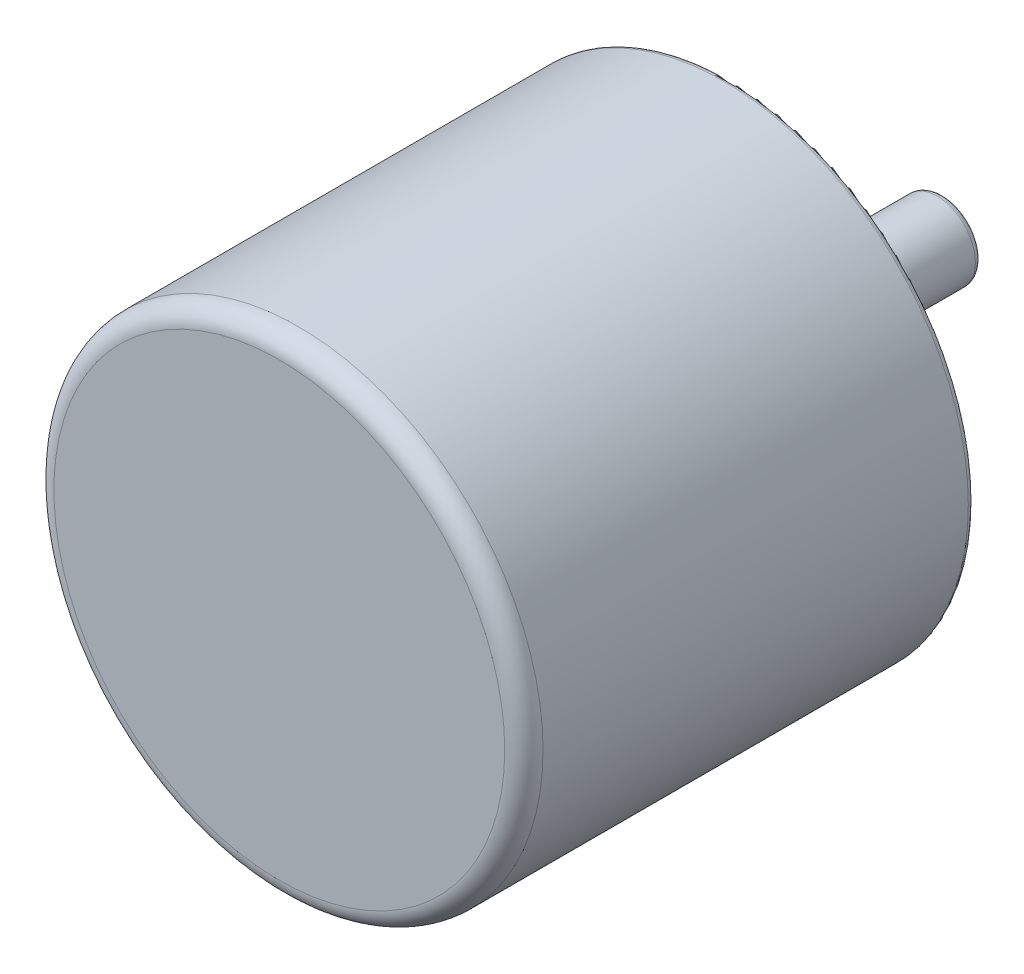
ISO-10303-21;
HEADER;
FILE_DESCRIPTION(('STEP AP214'),'2;1');
FILE_NAME('part.step','',(''),(''),'','','');
FILE_SCHEMA(('AUTOMOTIVE_DESIGN { 1 0 10303 214 1 1 1 1 }'));
ENDSEC;
DATA;
#1=APPLICATION_CONTEXT('core data for automotive mechanical design processes');
#2=APPLICATION_PROTOCOL_DEFINITION('international standard','automotive_design',2000,#1);
#3=PRODUCT_CONTEXT('',#1,'mechanical');
#4=PRODUCT('Part','Part','',(#3));
#5=PRODUCT_RELATED_PRODUCT_CATEGORY('part','',(#4));
#6=PRODUCT_DEFINITION_FORMATION('','',#4);
#7=PRODUCT_DEFINITION_CONTEXT('part definition',#1,'design');
#8=PRODUCT_DEFINITION('design','',#6,#7);
#9=PRODUCT_DEFINITION_SHAPE('','',#8);
#10=(LENGTH_UNIT() NAMED_UNIT(*) SI_UNIT(.MILLI.,.METRE.));
#11=(NAMED_UNIT(*) PLANE_ANGLE_UNIT() SI_UNIT($,.RADIAN.));
#12=(NAMED_UNIT(*) SI_UNIT($,.STERADIAN.) SOLID_ANGLE_UNIT());
#13=UNCERTAINTY_MEASURE_WITH_UNIT(LENGTH_MEASURE(1.E-05),#10,'distance_accuracy_value','');
#14=(GEOMETRIC_REPRESENTATION_CONTEXT(3) GLOBAL_UNCERTAINTY_ASSIGNED_CONTEXT((#13)) GLOBAL_UNIT_ASSIGNED_CONTEXT((#10,
#11,#12)) REPRESENTATION_CONTEXT('',''));
#15=CARTESIAN_POINT('',(0.,0.,0.));
#16=DIRECTION('',(0.,0.,1.));
#17=DIRECTION('',(1.,0.,0.));
#18=AXIS2_PLACEMENT_3D('',#15,#16,#17);
#19=CARTESIAN_POINT('',(0.,0.,35.3));
#20=DIRECTION('',(0.,0.,-1.));
#21=DIRECTION('',(-1.,0.,0.));
#22=AXIS2_PLACEMENT_3D('',#19,#20,#21);
#23=CYLINDRICAL_SURFACE('',#22,19.15);
#24=CARTESIAN_POINT('',(0.,0.,0.5));
#25=DIRECTION('',(0.,0.,1.));
#26=DIRECTION('',(1.,0.,0.));
#27=AXIS2_PLACEMENT_3D('',#24,#25,#26);
#28=CIRCLE('',#27,19.15);
#29=CARTESIAN_POINT('',(19.15,0.,0.5));
#30=VERTEX_POINT('',#29);
#31=EDGE_CURVE('E37',#30,#30,#28,.T.);
#32=ORIENTED_EDGE('',*,*,#31,.T.);
#33=EDGE_LOOP('',(#32));
#34=FACE_BOUND('',#33,.T.);
#35=CARTESIAN_POINT('',(0.,0.,33.8));
#36=DIRECTION('',(0.,0.,1.));
#37=DIRECTION('',(1.,0.,0.));
#38=AXIS2_PLACEMENT_3D('',#35,#36,#37);
#39=CIRCLE('',#38,19.15);
#40=CARTESIAN_POINT('',(19.15,0.,33.8));
#41=VERTEX_POINT('',#40);
#42=EDGE_CURVE('E56',#41,#41,#39,.F.);
#43=ORIENTED_EDGE('',*,*,#42,.T.);
#44=EDGE_LOOP('',(#43));
#45=FACE_BOUND('',#44,.T.);
#46=ADVANCED_FACE('F30',(#34,#45),#23,.T.);
#47=CARTESIAN_POINT('',(0.,0.,35.3));
#48=DIRECTION('',(0.,0.,1.));
#49=DIRECTION('',(1.,0.,0.));
#50=AXIS2_PLACEMENT_3D('',#47,#48,#49);
#51=PLANE('',#50);
#52=CARTESIAN_POINT('',(0.,0.,35.3));
#53=DIRECTION('',(0.,0.,1.));
#54=DIRECTION('',(1.,0.,0.));
#55=AXIS2_PLACEMENT_3D('',#52,#53,#54);
#56=CIRCLE('',#55,17.65);
#57=CARTESIAN_POINT('',(17.65,0.,35.3));
#58=VERTEX_POINT('',#57);
#59=EDGE_CURVE('E59',#58,#58,#56,.T.);
#60=ORIENTED_EDGE('',*,*,#59,.T.);
#61=EDGE_LOOP('',(#60));
#62=FACE_BOUND('',#61,.T.);
#63=ADVANCED_FACE('F124',(#62),#51,.T.);
#64=CARTESIAN_POINT('',(0.,0.,0.));
#65=DIRECTION('',(0.,0.,1.));
#66=DIRECTION('',(1.,0.,0.));
#67=AXIS2_PLACEMENT_3D('',#64,#65,#66);
#68=PLANE('',#67);
#69=CARTESIAN_POINT('',(0.,0.,0.));
#70=DIRECTION('',(0.,0.,1.));
#71=DIRECTION('',(1.,0.,0.));
#72=AXIS2_PLACEMENT_3D('',#69,#70,#71);
#73=CIRCLE('',#72,18.65);
#74=CARTESIAN_POINT('',(18.65,0.,0.));
#75=VERTEX_POINT('',#74);
#76=EDGE_CURVE('E10',#75,#75,#73,.F.);
#77=ORIENTED_EDGE('',*,*,#76,.T.);
#78=EDGE_LOOP('',(#77));
#79=FACE_BOUND('',#78,.T.);
#80=CARTESIAN_POINT('',(9.78471235545165,-10.2216390134391,0.));
#81=DIRECTION('',(0.,0.,-1.));
#82=DIRECTION('',(-1.,0.,0.));
#83=AXIS2_PLACEMENT_3D('',#80,#81,#82);
#84=CIRCLE('',#83,1.0085221382896);
#85=CARTESIAN_POINT('',(8.77619021716205,-10.2216390134391,0.));
#86=VERTEX_POINT('',#85);
#87=EDGE_CURVE('E81',#86,#86,#84,.T.);
#88=ORIENTED_EDGE('',*,*,#87,.F.);
#89=EDGE_LOOP('',(#88));
#90=FACE_BOUND('',#89,.T.);
#91=CARTESIAN_POINT('',(-12.2542594635513,-7.07499999999912,0.));
#92=DIRECTION('',(0.,0.,-1.));
#93=DIRECTION('',(-1.,0.,0.));
#94=AXIS2_PLACEMENT_3D('',#91,#92,#93);
#95=CIRCLE('',#94,1.02634430811281);
#96=CARTESIAN_POINT('',(-13.2806037716641,-7.07499999999912,0.));
#97=VERTEX_POINT('',#96);
#98=EDGE_CURVE('E95',#97,#97,#95,.T.);
#99=ORIENTED_EDGE('',*,*,#98,.F.);
#100=EDGE_LOOP('',(#99));
#101=FACE_BOUND('',#100,.T.);
#102=CARTESIAN_POINT('',(3.95984287622503,13.584628975265,0.));
#103=DIRECTION('',(0.,0.,-1.));
#104=DIRECTION('',(-1.,0.,0.));
#105=AXIS2_PLACEMENT_3D('',#102,#103,#104);
#106=CIRCLE('',#105,1.00852213828777);
#107=CARTESIAN_POINT('',(2.95132073793726,13.584628975265,0.));
#108=VERTEX_POINT('',#107);
#109=EDGE_CURVE('E88',#108,#108,#106,.T.);
#110=ORIENTED_EDGE('',*,*,#109,.F.);
#111=EDGE_LOOP('',(#110));
#112=FACE_BOUND('',#111,.T.);
#113=CARTESIAN_POINT('',(-13.7445552316797,-3.36298996182591,0.));
#114=DIRECTION('',(0.,0.,-1.));
#115=DIRECTION('',(-1.,0.,0.));
#116=AXIS2_PLACEMENT_3D('',#113,#114,#115);
#117=CIRCLE('',#116,1.00852213828903);
#118=CARTESIAN_POINT('',(-14.7530773699687,-3.36298996182591,0.));
#119=VERTEX_POINT('',#118);
#120=EDGE_CURVE('E105',#119,#119,#117,.T.);
#121=ORIENTED_EDGE('',*,*,#120,.F.);
#122=EDGE_LOOP('',(#121));
#123=FACE_BOUND('',#122,.T.);
#124=CARTESIAN_POINT('',(12.2542594635483,-7.07500000000088,0.));
#125=DIRECTION('',(0.,0.,-1.));
#126=DIRECTION('',(-1.,0.,0.));
#127=AXIS2_PLACEMENT_3D('',#124,#125,#126);
#128=CIRCLE('',#127,1.02634430811338);
#129=CARTESIAN_POINT('',(11.2279151554349,-7.07500000000088,0.));
#130=VERTEX_POINT('',#129);
#131=EDGE_CURVE('E87',#130,#130,#128,.T.);
#132=ORIENTED_EDGE('',*,*,#131,.F.);
#133=EDGE_LOOP('',(#132));
#134=FACE_BOUND('',#133,.T.);
#135=CARTESIAN_POINT('',(0.,14.15,0.));
#136=DIRECTION('',(0.,0.,-1.));
#137=DIRECTION('',(-1.,0.,0.));
#138=AXIS2_PLACEMENT_3D('',#135,#136,#137);
#139=CIRCLE('',#138,1.02634430811155);
#140=CARTESIAN_POINT('',(-1.02634430811155,14.15,0.));
#141=VERTEX_POINT('',#140);
#142=EDGE_CURVE('E75',#141,#141,#139,.T.);
#143=ORIENTED_EDGE('',*,*,#142,.F.);
#144=EDGE_LOOP('',(#143));
#145=FACE_BOUND('',#144,.T.);
#146=CARTESIAN_POINT('',(0.,0.,0.));
#147=DIRECTION('',(0.,0.,1.));
#148=DIRECTION('',(1.,0.,0.));
#149=AXIS2_PLACEMENT_3D('',#146,#147,#148);
#150=CIRCLE('',#149,10.);
#151=CARTESIAN_POINT('',(10.,0.,0.));
#152=VERTEX_POINT('',#151);
#153=EDGE_CURVE('E65',#152,#152,#150,.F.);
#154=ORIENTED_EDGE('',*,*,#153,.F.);
#155=EDGE_LOOP('',(#154));
#156=FACE_BOUND('',#155,.T.);
#157=ADVANCED_FACE('F120',(#79,#90,#101,#112,#123,#134,#145,#156),#68,.F.);
#158=CARTESIAN_POINT('',(0.,0.,-4.7));
#159=DIRECTION('',(0.,0.,-1.));
#160=DIRECTION('',(-1.,0.,0.));
#161=AXIS2_PLACEMENT_3D('',#158,#159,#160);
#162=PLANE('',#161);
#163=CARTESIAN_POINT('',(0.,0.,-4.7));
#164=DIRECTION('',(0.,0.,-1.));
#165=DIRECTION('',(-1.,0.,0.));
#166=AXIS2_PLACEMENT_3D('',#163,#164,#165);
#167=CIRCLE('',#166,9.5);
#168=CARTESIAN_POINT('',(-9.5,0.,-4.7));
#169=VERTEX_POINT('',#168);
#170=EDGE_CURVE('E45',#169,#169,#167,.T.);
#171=ORIENTED_EDGE('',*,*,#170,.T.);
#172=EDGE_LOOP('',(#171));
#173=FACE_BOUND('',#172,.T.);
#174=CARTESIAN_POINT('',(0.,0.,-4.7));
#175=DIRECTION('',(0.,0.,-1.));
#176=DIRECTION('',(-1.,0.,0.));
#177=AXIS2_PLACEMENT_3D('',#174,#175,#176);
#178=CIRCLE('',#177,7.5);
#179=CARTESIAN_POINT('',(-7.5,0.,-4.7));
#180=VERTEX_POINT('',#179);
#181=EDGE_CURVE('E68',#180,#180,#178,.T.);
#182=ORIENTED_EDGE('',*,*,#181,.F.);
#183=EDGE_LOOP('',(#182));
#184=FACE_BOUND('',#183,.T.);
#185=ADVANCED_FACE('F123',(#173,#184),#162,.T.);
#186=CARTESIAN_POINT('',(0.,0.,-4.7));
#187=DIRECTION('',(0.,0.,1.));
#188=DIRECTION('',(1.,0.,0.));
#189=AXIS2_PLACEMENT_3D('',#186,#187,#188);
#190=CYLINDRICAL_SURFACE('',#189,10.);
#191=CARTESIAN_POINT('',(0.,0.,-4.2));
#192=DIRECTION('',(0.,0.,-1.));
#193=DIRECTION('',(-1.,0.,0.));
#194=AXIS2_PLACEMENT_3D('',#191,#192,#193);
#195=CIRCLE('',#194,10.);
#196=CARTESIAN_POINT('',(-10.,0.,-4.2));
#197=VERTEX_POINT('',#196);
#198=EDGE_CURVE('E41',#197,#197,#195,.F.);
#199=ORIENTED_EDGE('',*,*,#198,.T.);
#200=EDGE_LOOP('',(#199));
#201=FACE_BOUND('',#200,.T.);
#202=ORIENTED_EDGE('',*,*,#153,.T.);
#203=EDGE_LOOP('',(#202));
#204=FACE_BOUND('',#203,.T.);
#205=ADVANCED_FACE('F133',(#201,#204),#190,.T.);
#206=CARTESIAN_POINT('',(0.,0.,-4.7));
#207=DIRECTION('',(0.,0.,1.));
#208=DIRECTION('',(1.,0.,0.));
#209=AXIS2_PLACEMENT_3D('',#206,#207,#208);
#210=CYLINDRICAL_SURFACE('',#209,7.5);
#211=ORIENTED_EDGE('',*,*,#181,.T.);
#212=EDGE_LOOP('',(#211));
#213=FACE_BOUND('',#212,.T.);
#214=CARTESIAN_POINT('',(0.,0.,0.));
#215=DIRECTION('',(0.,0.,-1.));
#216=DIRECTION('',(-1.,0.,0.));
#217=AXIS2_PLACEMENT_3D('',#214,#215,#216);
#218=CIRCLE('',#217,7.5);
#219=CARTESIAN_POINT('',(-7.5,0.,0.));
#220=VERTEX_POINT('',#219);
#221=EDGE_CURVE('E69',#220,#220,#218,.T.);
#222=ORIENTED_EDGE('',*,*,#221,.F.);
#223=EDGE_LOOP('',(#222));
#224=FACE_BOUND('',#223,.T.);
#225=ADVANCED_FACE('F135',(#213,#224),#210,.F.);
#226=CARTESIAN_POINT('',(0.,0.,0.));
#227=DIRECTION('',(0.,0.,1.));
#228=DIRECTION('',(1.,0.,0.));
#229=AXIS2_PLACEMENT_3D('',#226,#227,#228);
#230=CIRCLE('',#229,3.);
#231=CARTESIAN_POINT('',(3.,0.,0.));
#232=VERTEX_POINT('',#231);
#233=EDGE_CURVE('E62',#232,#232,#230,.F.);
#234=ORIENTED_EDGE('',*,*,#233,.F.);
#235=EDGE_LOOP('',(#234));
#236=FACE_BOUND('',#235,.T.);
#237=ORIENTED_EDGE('',*,*,#221,.T.);
#238=EDGE_LOOP('',(#237));
#239=FACE_BOUND('',#238,.T.);
#240=ADVANCED_FACE('F126',(#236,#239),#68,.F.);
#241=CARTESIAN_POINT('',(0.,0.,-16.7));
#242=DIRECTION('',(0.,0.,1.));
#243=DIRECTION('',(1.,0.,0.));
#244=AXIS2_PLACEMENT_3D('',#241,#242,#243);
#245=CYLINDRICAL_SURFACE('',#244,3.);
#246=CARTESIAN_POINT('',(0.,0.,-16.2));
#247=DIRECTION('',(0.,0.,-1.));
#248=DIRECTION('',(-1.,0.,0.));
#249=AXIS2_PLACEMENT_3D('',#246,#247,#248);
#250=CIRCLE('',#249,3.);
#251=CARTESIAN_POINT('',(-3.,0.,-16.2));
#252=VERTEX_POINT('',#251);
#253=EDGE_CURVE('E50',#252,#252,#250,.F.);
#254=ORIENTED_EDGE('',*,*,#253,.T.);
#255=EDGE_LOOP('',(#254));
#256=FACE_BOUND('',#255,.T.);
#257=ORIENTED_EDGE('',*,*,#233,.T.);
#258=EDGE_LOOP('',(#257));
#259=FACE_BOUND('',#258,.T.);
#260=ADVANCED_FACE('F179',(#256,#259),#245,.T.);
#261=CARTESIAN_POINT('',(0.,0.,-16.7));
#262=DIRECTION('',(0.,0.,-1.));
#263=DIRECTION('',(-1.,0.,0.));
#264=AXIS2_PLACEMENT_3D('',#261,#262,#263);
#265=PLANE('',#264);
#266=CARTESIAN_POINT('',(0.,0.,-16.7));
#267=DIRECTION('',(0.,0.,-1.));
#268=DIRECTION('',(-1.,0.,0.));
#269=AXIS2_PLACEMENT_3D('',#266,#267,#268);
#270=CIRCLE('',#269,2.5);
#271=CARTESIAN_POINT('',(-2.5,0.,-16.7));
#272=VERTEX_POINT('',#271);
#273=EDGE_CURVE('E53',#272,#272,#270,.T.);
#274=ORIENTED_EDGE('',*,*,#273,.T.);
#275=EDGE_LOOP('',(#274));
#276=FACE_BOUND('',#275,.T.);
#277=ADVANCED_FACE('F184',(#276),#265,.T.);
#278=CARTESIAN_POINT('',(0.,14.15,6.8));
#279=DIRECTION('',(0.,0.,-1.));
#280=DIRECTION('',(-1.,0.,0.));
#281=AXIS2_PLACEMENT_3D('',#278,#279,#280);
#282=CYLINDRICAL_SURFACE('',#281,1.02634430811155);
#283=CARTESIAN_POINT('',(0.,14.15,6.8));
#284=DIRECTION('',(0.,0.,-1.));
#285=DIRECTION('',(-1.,0.,0.));
#286=AXIS2_PLACEMENT_3D('',#283,#284,#285);
#287=CIRCLE('',#286,1.02634430811155);
#288=CARTESIAN_POINT('',(-1.02634430811155,14.15,6.8));
#289=VERTEX_POINT('',#288);
#290=EDGE_CURVE('E72',#289,#289,#287,.T.);
#291=ORIENTED_EDGE('',*,*,#290,.F.);
#292=EDGE_LOOP('',(#291));
#293=FACE_BOUND('',#292,.T.);
#294=ORIENTED_EDGE('',*,*,#142,.T.);
#295=EDGE_LOOP('',(#294));
#296=FACE_BOUND('',#295,.T.);
#297=ADVANCED_FACE('F192',(#293,#296),#282,.F.);
#298=CARTESIAN_POINT('',(0.,14.15,6.8));
#299=DIRECTION('',(0.,0.,-1.));
#300=DIRECTION('',(-1.,0.,0.));
#301=AXIS2_PLACEMENT_3D('',#298,#299,#300);
#302=PLANE('',#301);
#303=ORIENTED_EDGE('',*,*,#290,.T.);
#304=EDGE_LOOP('',(#303));
#305=FACE_BOUND('',#304,.T.);
#306=ADVANCED_FACE('F198',(#305),#302,.T.);
#307=CARTESIAN_POINT('',(12.2542594635483,-7.07500000000088,6.8));
#308=DIRECTION('',(0.,0.,-1.));
#309=DIRECTION('',(-1.,0.,0.));
#310=AXIS2_PLACEMENT_3D('',#307,#308,#309);
#311=CYLINDRICAL_SURFACE('',#310,1.02634430811338);
#312=CARTESIAN_POINT('',(12.2542594635483,-7.07500000000088,6.8));
#313=DIRECTION('',(0.,0.,-1.));
#314=DIRECTION('',(-1.,0.,0.));
#315=AXIS2_PLACEMENT_3D('',#312,#313,#314);
#316=CIRCLE('',#315,1.02634430811338);
#317=CARTESIAN_POINT('',(11.2279151554349,-7.07500000000088,6.8));
#318=VERTEX_POINT('',#317);
#319=EDGE_CURVE('E102',#318,#318,#316,.T.);
#320=ORIENTED_EDGE('',*,*,#319,.F.);
#321=EDGE_LOOP('',(#320));
#322=FACE_BOUND('',#321,.T.);
#323=ORIENTED_EDGE('',*,*,#131,.T.);
#324=EDGE_LOOP('',(#323));
#325=FACE_BOUND('',#324,.T.);
#326=ADVANCED_FACE('F202',(#322,#325),#311,.F.);
#327=CARTESIAN_POINT('',(12.2542594635483,-7.07500000000088,6.8));
#328=DIRECTION('',(0.,0.,-1.));
#329=DIRECTION('',(-1.,0.,0.));
#330=AXIS2_PLACEMENT_3D('',#327,#328,#329);
#331=PLANE('',#330);
#332=ORIENTED_EDGE('',*,*,#319,.T.);
#333=EDGE_LOOP('',(#332));
#334=FACE_BOUND('',#333,.T.);
#335=ADVANCED_FACE('F116',(#334),#331,.T.);
#336=CARTESIAN_POINT('',(-13.7445552316797,-3.36298996182591,6.8));
#337=DIRECTION('',(0.,0.,-1.));
#338=DIRECTION('',(-1.,0.,0.));
#339=AXIS2_PLACEMENT_3D('',#336,#337,#338);
#340=CYLINDRICAL_SURFACE('',#339,1.00852213828903);
#341=CARTESIAN_POINT('',(-13.7445552316797,-3.36298996182591,6.8));
#342=DIRECTION('',(0.,0.,-1.));
#343=DIRECTION('',(-1.,0.,0.));
#344=AXIS2_PLACEMENT_3D('',#341,#342,#343);
#345=CIRCLE('',#344,1.00852213828903);
#346=CARTESIAN_POINT('',(-14.7530773699687,-3.36298996182591,6.8));
#347=VERTEX_POINT('',#346);
#348=EDGE_CURVE('E92',#347,#347,#345,.T.);
#349=ORIENTED_EDGE('',*,*,#348,.F.);
#350=EDGE_LOOP('',(#349));
#351=FACE_BOUND('',#350,.T.);
#352=ORIENTED_EDGE('',*,*,#120,.T.);
#353=EDGE_LOOP('',(#352));
#354=FACE_BOUND('',#353,.T.);
#355=ADVANCED_FACE('F113',(#351,#354),#340,.F.);
#356=CARTESIAN_POINT('',(-13.7445552316797,-3.36298996182591,6.8));
#357=DIRECTION('',(0.,0.,-1.));
#358=DIRECTION('',(-1.,0.,0.));
#359=AXIS2_PLACEMENT_3D('',#356,#357,#358);
#360=PLANE('',#359);
#361=ORIENTED_EDGE('',*,*,#348,.T.);
#362=EDGE_LOOP('',(#361));
#363=FACE_BOUND('',#362,.T.);
#364=ADVANCED_FACE('F111',(#363),#360,.T.);
#365=CARTESIAN_POINT('',(3.95984287622503,13.584628975265,6.8));
#366=DIRECTION('',(0.,0.,-1.));
#367=DIRECTION('',(-1.,0.,0.));
#368=AXIS2_PLACEMENT_3D('',#365,#366,#367);
#369=CYLINDRICAL_SURFACE('',#368,1.00852213828777);
#370=CARTESIAN_POINT('',(3.95984287622503,13.584628975265,6.8));
#371=DIRECTION('',(0.,0.,-1.));
#372=DIRECTION('',(-1.,0.,0.));
#373=AXIS2_PLACEMENT_3D('',#370,#371,#372);
#374=CIRCLE('',#373,1.00852213828777);
#375=CARTESIAN_POINT('',(2.95132073793726,13.584628975265,6.8));
#376=VERTEX_POINT('',#375);
#377=EDGE_CURVE('E91',#376,#376,#374,.T.);
#378=ORIENTED_EDGE('',*,*,#377,.F.);
#379=EDGE_LOOP('',(#378));
#380=FACE_BOUND('',#379,.T.);
#381=ORIENTED_EDGE('',*,*,#109,.T.);
#382=EDGE_LOOP('',(#381));
#383=FACE_BOUND('',#382,.T.);
#384=ADVANCED_FACE('F212',(#380,#383),#369,.F.);
#385=CARTESIAN_POINT('',(3.95984287622503,13.584628975265,6.8));
#386=DIRECTION('',(0.,0.,-1.));
#387=DIRECTION('',(-1.,0.,0.));
#388=AXIS2_PLACEMENT_3D('',#385,#386,#387);
#389=PLANE('',#388);
#390=ORIENTED_EDGE('',*,*,#377,.T.);
#391=EDGE_LOOP('',(#390));
#392=FACE_BOUND('',#391,.T.);
#393=ADVANCED_FACE('F215',(#392),#389,.T.);
#394=CARTESIAN_POINT('',(-12.2542594635513,-7.07499999999912,6.8));
#395=DIRECTION('',(0.,0.,-1.));
#396=DIRECTION('',(-1.,0.,0.));
#397=AXIS2_PLACEMENT_3D('',#394,#395,#396);
#398=CYLINDRICAL_SURFACE('',#397,1.02634430811281);
#399=CARTESIAN_POINT('',(-12.2542594635513,-7.07499999999912,6.8));
#400=DIRECTION('',(0.,0.,-1.));
#401=DIRECTION('',(-1.,0.,0.));
#402=AXIS2_PLACEMENT_3D('',#399,#400,#401);
#403=CIRCLE('',#402,1.02634430811281);
#404=CARTESIAN_POINT('',(-13.2806037716641,-7.07499999999912,6.8));
#405=VERTEX_POINT('',#404);
#406=EDGE_CURVE('E78',#405,#405,#403,.T.);
#407=ORIENTED_EDGE('',*,*,#406,.F.);
#408=EDGE_LOOP('',(#407));
#409=FACE_BOUND('',#408,.T.);
#410=ORIENTED_EDGE('',*,*,#98,.T.);
#411=EDGE_LOOP('',(#410));
#412=FACE_BOUND('',#411,.T.);
#413=ADVANCED_FACE('F219',(#409,#412),#398,.F.);
#414=CARTESIAN_POINT('',(-12.2542594635513,-7.07499999999912,6.8));
#415=DIRECTION('',(0.,0.,-1.));
#416=DIRECTION('',(-1.,0.,0.));
#417=AXIS2_PLACEMENT_3D('',#414,#415,#416);
#418=PLANE('',#417);
#419=ORIENTED_EDGE('',*,*,#406,.T.);
#420=EDGE_LOOP('',(#419));
#421=FACE_BOUND('',#420,.T.);
#422=ADVANCED_FACE('F207',(#421),#418,.T.);
#423=CARTESIAN_POINT('',(9.78471235545165,-10.2216390134391,6.8));
#424=DIRECTION('',(0.,0.,-1.));
#425=DIRECTION('',(-1.,0.,0.));
#426=AXIS2_PLACEMENT_3D('',#423,#424,#425);
#427=CYLINDRICAL_SURFACE('',#426,1.0085221382896);
#428=CARTESIAN_POINT('',(9.78471235545165,-10.2216390134391,6.8));
#429=DIRECTION('',(0.,0.,-1.));
#430=DIRECTION('',(-1.,0.,0.));
#431=AXIS2_PLACEMENT_3D('',#428,#429,#430);
#432=CIRCLE('',#431,1.0085221382896);
#433=CARTESIAN_POINT('',(8.77619021716205,-10.2216390134391,6.8));
#434=VERTEX_POINT('',#433);
#435=EDGE_CURVE('E84',#434,#434,#432,.T.);
#436=ORIENTED_EDGE('',*,*,#435,.F.);
#437=EDGE_LOOP('',(#436));
#438=FACE_BOUND('',#437,.T.);
#439=ORIENTED_EDGE('',*,*,#87,.T.);
#440=EDGE_LOOP('',(#439));
#441=FACE_BOUND('',#440,.T.);
#442=ADVANCED_FACE('F204',(#438,#441),#427,.F.);
#443=CARTESIAN_POINT('',(9.78471235545165,-10.2216390134391,6.8));
#444=DIRECTION('',(0.,0.,-1.));
#445=DIRECTION('',(-1.,0.,0.));
#446=AXIS2_PLACEMENT_3D('',#443,#444,#445);
#447=PLANE('',#446);
#448=ORIENTED_EDGE('',*,*,#435,.T.);
#449=EDGE_LOOP('',(#448));
#450=FACE_BOUND('',#449,.T.);
#451=ADVANCED_FACE('F159',(#450),#447,.T.);
#452=CARTESIAN_POINT('',(0.,0.,33.8));
#453=DIRECTION('',(0.,0.,1.));
#454=DIRECTION('',(1.,0.,0.));
#455=AXIS2_PLACEMENT_3D('',#452,#453,#454);
#456=TOROIDAL_SURFACE('',#455,17.65,1.5);
#457=ORIENTED_EDGE('',*,*,#42,.F.);
#458=EDGE_LOOP('',(#457));
#459=FACE_BOUND('',#458,.T.);
#460=ORIENTED_EDGE('',*,*,#59,.F.);
#461=EDGE_LOOP('',(#460));
#462=FACE_BOUND('',#461,.T.);
#463=ADVANCED_FACE('F155',(#459,#462),#456,.T.);
#464=CARTESIAN_POINT('',(0.,0.,-16.2));
#465=DIRECTION('',(0.,0.,-1.));
#466=DIRECTION('',(-1.,0.,0.));
#467=AXIS2_PLACEMENT_3D('',#464,#465,#466);
#468=TOROIDAL_SURFACE('',#467,2.5,0.5);
#469=ORIENTED_EDGE('',*,*,#253,.F.);
#470=EDGE_LOOP('',(#469));
#471=FACE_BOUND('',#470,.T.);
#472=ORIENTED_EDGE('',*,*,#273,.F.);
#473=EDGE_LOOP('',(#472));
#474=FACE_BOUND('',#473,.T.);
#475=ADVANCED_FACE('F158',(#471,#474),#468,.T.);
#476=CARTESIAN_POINT('',(0.,0.,-4.2));
#477=DIRECTION('',(0.,0.,-1.));
#478=DIRECTION('',(-1.,0.,0.));
#479=AXIS2_PLACEMENT_3D('',#476,#477,#478);
#480=TOROIDAL_SURFACE('',#479,9.5,0.5);
#481=ORIENTED_EDGE('',*,*,#198,.F.);
#482=EDGE_LOOP('',(#481));
#483=FACE_BOUND('',#482,.T.);
#484=ORIENTED_EDGE('',*,*,#170,.F.);
#485=EDGE_LOOP('',(#484));
#486=FACE_BOUND('',#485,.T.);
#487=ADVANCED_FACE('F162',(#483,#486),#480,.T.);
#488=CARTESIAN_POINT('',(0.,0.,0.5));
#489=DIRECTION('',(0.,0.,1.));
#490=DIRECTION('',(1.,0.,0.));
#491=AXIS2_PLACEMENT_3D('',#488,#489,#490);
#492=TOROIDAL_SURFACE('',#491,18.65,0.5);
#493=ORIENTED_EDGE('',*,*,#76,.F.);
#494=EDGE_LOOP('',(#493));
#495=FACE_BOUND('',#494,.T.);
#496=ORIENTED_EDGE('',*,*,#31,.F.);
#497=EDGE_LOOP('',(#496));
#498=FACE_BOUND('',#497,.T.);
#499=ADVANCED_FACE('F32',(#495,#498),#492,.T.);
#500=CLOSED_SHELL('',(#46,#63,#157,#185,#205,#225,#240,#260,#277,#297,#306,#326,#335,#355,#364,
#384,#393,#413,#422,#442,#451,#463,#475,#487,#499));
#501=MANIFOLD_SOLID_BREP('B2',#500);
#502=ADVANCED_BREP_SHAPE_REPRESENTATION('',(#18,#501),#14);
#503=SHAPE_DEFINITION_REPRESENTATION(#9,#502);
ENDSEC;
END-ISO-10303-21;
